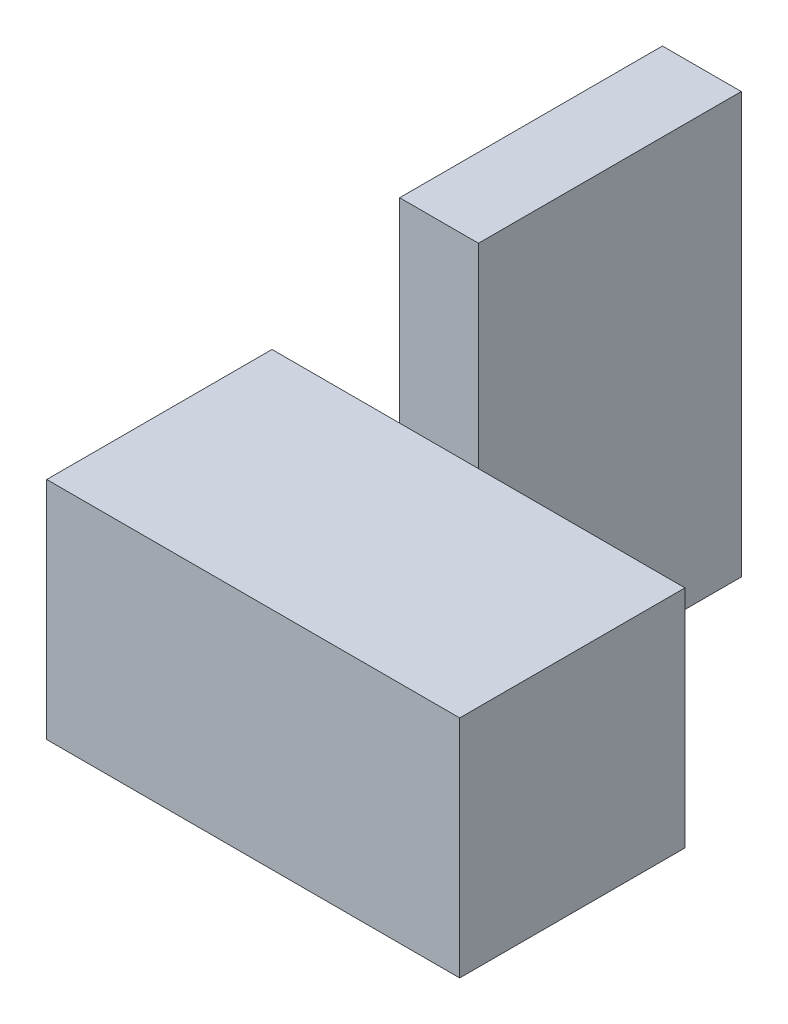
ISO-10303-21;
HEADER;
FILE_DESCRIPTION(('STEP AP214'),'2;1');
FILE_NAME('part.step','',(''),(''),'','','');
FILE_SCHEMA(('AUTOMOTIVE_DESIGN { 1 0 10303 214 1 1 1 1 }'));
ENDSEC;
DATA;
#1=APPLICATION_CONTEXT('core data for automotive mechanical design processes');
#2=APPLICATION_PROTOCOL_DEFINITION('international standard','automotive_design',2000,#1);
#3=PRODUCT_CONTEXT('',#1,'mechanical');
#4=PRODUCT('Part','Part','',(#3));
#5=PRODUCT_RELATED_PRODUCT_CATEGORY('part','',(#4));
#6=PRODUCT_DEFINITION_FORMATION('','',#4);
#7=PRODUCT_DEFINITION_CONTEXT('part definition',#1,'design');
#8=PRODUCT_DEFINITION('design','',#6,#7);
#9=PRODUCT_DEFINITION_SHAPE('','',#8);
#10=(LENGTH_UNIT() NAMED_UNIT(*) SI_UNIT(.MILLI.,.METRE.));
#11=(NAMED_UNIT(*) PLANE_ANGLE_UNIT() SI_UNIT($,.RADIAN.));
#12=(NAMED_UNIT(*) SI_UNIT($,.STERADIAN.) SOLID_ANGLE_UNIT());
#13=UNCERTAINTY_MEASURE_WITH_UNIT(LENGTH_MEASURE(1.E-05),#10,'distance_accuracy_value','');
#14=(GEOMETRIC_REPRESENTATION_CONTEXT(3) GLOBAL_UNCERTAINTY_ASSIGNED_CONTEXT((#13)) GLOBAL_UNIT_ASSIGNED_CONTEXT((#10,
#11,#12)) REPRESENTATION_CONTEXT('',''));
#15=CARTESIAN_POINT('',(0.,0.,0.));
#16=DIRECTION('',(0.,0.,1.));
#17=DIRECTION('',(1.,0.,0.));
#18=AXIS2_PLACEMENT_3D('',#15,#16,#17);
#19=CARTESIAN_POINT('',(27.5,30.,85.));
#20=DIRECTION('',(0.,0.,1.));
#21=DIRECTION('',(-1.,0.,0.));
#22=AXIS2_PLACEMENT_3D('',#19,#20,#21);
#23=PLANE('',#22);
#24=DIRECTION('',(0.,1.,0.));
#25=VECTOR('',#24,1.);
#26=CARTESIAN_POINT('',(0.,56.,85.));
#27=LINE('',#26,#25);
#28=CARTESIAN_POINT('',(0.,0.,85.));
#29=VERTEX_POINT('',#28);
#30=CARTESIAN_POINT('',(0.,30.,85.));
#31=VERTEX_POINT('',#30);
#32=EDGE_CURVE('E271',#29,#31,#27,.T.);
#33=ORIENTED_EDGE('',*,*,#32,.T.);
#34=DIRECTION('',(1.,0.,0.));
#35=VECTOR('',#34,1.);
#36=CARTESIAN_POINT('',(27.5,30.,85.));
#37=LINE('',#36,#35);
#38=CARTESIAN_POINT('',(27.5,30.,85.));
#39=VERTEX_POINT('',#38);
#40=EDGE_CURVE('E297',#31,#39,#37,.T.);
#41=ORIENTED_EDGE('',*,*,#40,.T.);
#42=DIRECTION('',(0.,-1.,0.));
#43=VECTOR('',#42,1.);
#44=CARTESIAN_POINT('',(27.5,30.,85.));
#45=LINE('',#44,#43);
#46=CARTESIAN_POINT('',(27.5,0.,85.));
#47=VERTEX_POINT('',#46);
#48=EDGE_CURVE('E331',#39,#47,#45,.T.);
#49=ORIENTED_EDGE('',*,*,#48,.T.);
#50=DIRECTION('',(1.,0.,0.));
#51=VECTOR('',#50,1.);
#52=CARTESIAN_POINT('',(27.5,0.,85.));
#53=LINE('',#52,#51);
#54=EDGE_CURVE('E314',#29,#47,#53,.T.);
#55=ORIENTED_EDGE('',*,*,#54,.F.);
#56=EDGE_LOOP('',(#33,#41,#49,#55));
#57=FACE_BOUND('',#56,.T.);
#58=ADVANCED_FACE('F42',(#57),#23,.F.);
#59=DIRECTION('',(0.,-1.,0.));
#60=VECTOR('',#59,1.);
#61=CARTESIAN_POINT('',(-10.5,56.,85.));
#62=LINE('',#61,#60);
#63=CARTESIAN_POINT('',(-10.5,30.,85.));
#64=VERTEX_POINT('',#63);
#65=CARTESIAN_POINT('',(-10.5,0.,85.));
#66=VERTEX_POINT('',#65);
#67=EDGE_CURVE('E11',#64,#66,#62,.T.);
#68=ORIENTED_EDGE('',*,*,#67,.T.);
#69=CARTESIAN_POINT('',(-27.5,0.,85.));
#70=VERTEX_POINT('',#69);
#71=EDGE_CURVE('E315',#70,#66,#53,.T.);
#72=ORIENTED_EDGE('',*,*,#71,.F.);
#73=DIRECTION('',(0.,-1.,0.));
#74=VECTOR('',#73,1.);
#75=CARTESIAN_POINT('',(-27.5,30.,85.));
#76=LINE('',#75,#74);
#77=CARTESIAN_POINT('',(-27.5,30.,85.));
#78=VERTEX_POINT('',#77);
#79=EDGE_CURVE('E46',#78,#70,#76,.T.);
#80=ORIENTED_EDGE('',*,*,#79,.F.);
#81=EDGE_CURVE('E299',#78,#64,#37,.T.);
#82=ORIENTED_EDGE('',*,*,#81,.T.);
#83=EDGE_LOOP('',(#68,#72,#80,#82));
#84=FACE_BOUND('',#83,.T.);
#85=ADVANCED_FACE('F348',(#84),#23,.F.);
#86=CARTESIAN_POINT('',(-27.5,30.,115.));
#87=DIRECTION('',(1.,0.,0.));
#88=DIRECTION('',(0.,0.,1.));
#89=AXIS2_PLACEMENT_3D('',#86,#87,#88);
#90=PLANE('',#89);
#91=DIRECTION('',(0.,0.,-1.));
#92=VECTOR('',#91,1.);
#93=CARTESIAN_POINT('',(-27.5,0.,115.));
#94=LINE('',#93,#92);
#95=CARTESIAN_POINT('',(-27.5,0.,115.));
#96=VERTEX_POINT('',#95);
#97=EDGE_CURVE('E293',#96,#70,#94,.T.);
#98=ORIENTED_EDGE('',*,*,#97,.F.);
#99=DIRECTION('',(0.,-1.,0.));
#100=VECTOR('',#99,1.);
#101=CARTESIAN_POINT('',(-27.5,30.,115.));
#102=LINE('',#101,#100);
#103=CARTESIAN_POINT('',(-27.5,30.,115.));
#104=VERTEX_POINT('',#103);
#105=EDGE_CURVE('E311',#104,#96,#102,.T.);
#106=ORIENTED_EDGE('',*,*,#105,.F.);
#107=DIRECTION('',(0.,0.,-1.));
#108=VECTOR('',#107,1.);
#109=CARTESIAN_POINT('',(-27.5,30.,115.));
#110=LINE('',#109,#108);
#111=EDGE_CURVE('E294',#104,#78,#110,.T.);
#112=ORIENTED_EDGE('',*,*,#111,.T.);
#113=ORIENTED_EDGE('',*,*,#79,.T.);
#114=EDGE_LOOP('',(#98,#106,#112,#113));
#115=FACE_BOUND('',#114,.T.);
#116=ADVANCED_FACE('F44',(#115),#90,.F.);
#117=CARTESIAN_POINT('',(27.5,30.,115.));
#118=DIRECTION('',(-1.,0.,0.));
#119=DIRECTION('',(0.,0.,-1.));
#120=AXIS2_PLACEMENT_3D('',#117,#118,#119);
#121=PLANE('',#120);
#122=DIRECTION('',(0.,0.,1.));
#123=VECTOR('',#122,1.);
#124=CARTESIAN_POINT('',(27.5,0.,115.));
#125=LINE('',#124,#123);
#126=CARTESIAN_POINT('',(27.5,0.,115.));
#127=VERTEX_POINT('',#126);
#128=EDGE_CURVE('E319',#47,#127,#125,.T.);
#129=ORIENTED_EDGE('',*,*,#128,.F.);
#130=ORIENTED_EDGE('',*,*,#48,.F.);
#131=DIRECTION('',(0.,0.,1.));
#132=VECTOR('',#131,1.);
#133=CARTESIAN_POINT('',(27.5,30.,115.));
#134=LINE('',#133,#132);
#135=CARTESIAN_POINT('',(27.5,30.,115.));
#136=VERTEX_POINT('',#135);
#137=EDGE_CURVE('E303',#39,#136,#134,.T.);
#138=ORIENTED_EDGE('',*,*,#137,.T.);
#139=DIRECTION('',(0.,-1.,0.));
#140=VECTOR('',#139,1.);
#141=CARTESIAN_POINT('',(27.5,30.,115.));
#142=LINE('',#141,#140);
#143=EDGE_CURVE('E328',#136,#127,#142,.T.);
#144=ORIENTED_EDGE('',*,*,#143,.T.);
#145=EDGE_LOOP('',(#129,#130,#138,#144));
#146=FACE_BOUND('',#145,.T.);
#147=ADVANCED_FACE('F381',(#146),#121,.F.);
#148=CARTESIAN_POINT('',(27.5,30.,115.));
#149=DIRECTION('',(0.,0.,-1.));
#150=DIRECTION('',(1.,0.,0.));
#151=AXIS2_PLACEMENT_3D('',#148,#149,#150);
#152=PLANE('',#151);
#153=DIRECTION('',(-1.,0.,0.));
#154=VECTOR('',#153,1.);
#155=CARTESIAN_POINT('',(27.5,0.,115.));
#156=LINE('',#155,#154);
#157=EDGE_CURVE('E298',#127,#96,#156,.T.);
#158=ORIENTED_EDGE('',*,*,#157,.F.);
#159=ORIENTED_EDGE('',*,*,#143,.F.);
#160=DIRECTION('',(-1.,0.,0.));
#161=VECTOR('',#160,1.);
#162=CARTESIAN_POINT('',(27.5,30.,115.));
#163=LINE('',#162,#161);
#164=EDGE_CURVE('E308',#136,#104,#163,.T.);
#165=ORIENTED_EDGE('',*,*,#164,.T.);
#166=ORIENTED_EDGE('',*,*,#105,.T.);
#167=EDGE_LOOP('',(#158,#159,#165,#166));
#168=FACE_BOUND('',#167,.T.);
#169=ADVANCED_FACE('F356',(#168),#152,.F.);
#170=CARTESIAN_POINT('',(0.,30.,100.));
#171=DIRECTION('',(0.,-1.,0.));
#172=DIRECTION('',(0.,0.,1.));
#173=AXIS2_PLACEMENT_3D('',#170,#171,#172);
#174=PLANE('',#173);
#175=ORIENTED_EDGE('',*,*,#111,.F.);
#176=ORIENTED_EDGE('',*,*,#164,.F.);
#177=ORIENTED_EDGE('',*,*,#137,.F.);
#178=ORIENTED_EDGE('',*,*,#40,.F.);
#179=EDGE_CURVE('E304',#64,#31,#37,.T.);
#180=ORIENTED_EDGE('',*,*,#179,.F.);
#181=ORIENTED_EDGE('',*,*,#81,.F.);
#182=EDGE_LOOP('',(#175,#176,#177,#178,#180,#181));
#183=FACE_BOUND('',#182,.T.);
#184=ADVANCED_FACE('F358',(#183),#174,.F.);
#185=CARTESIAN_POINT('',(0.,0.,100.));
#186=DIRECTION('',(0.,-1.,0.));
#187=DIRECTION('',(0.,0.,1.));
#188=AXIS2_PLACEMENT_3D('',#185,#186,#187);
#189=PLANE('',#188);
#190=ORIENTED_EDGE('',*,*,#97,.T.);
#191=ORIENTED_EDGE('',*,*,#71,.T.);
#192=DIRECTION('',(0.,0.,1.));
#193=VECTOR('',#192,1.);
#194=CARTESIAN_POINT('',(-10.5,0.,50.));
#195=LINE('',#194,#193);
#196=CARTESIAN_POINT('',(-10.5,0.,50.));
#197=VERTEX_POINT('',#196);
#198=EDGE_CURVE('E282',#197,#66,#195,.T.);
#199=ORIENTED_EDGE('',*,*,#198,.F.);
#200=DIRECTION('',(1.,0.,0.));
#201=VECTOR('',#200,1.);
#202=CARTESIAN_POINT('',(-10.5,0.,50.));
#203=LINE('',#202,#201);
#204=CARTESIAN_POINT('',(0.,0.,50.));
#205=VERTEX_POINT('',#204);
#206=EDGE_CURVE('E266',#197,#205,#203,.T.);
#207=ORIENTED_EDGE('',*,*,#206,.T.);
#208=DIRECTION('',(0.,0.,1.));
#209=VECTOR('',#208,1.);
#210=CARTESIAN_POINT('',(0.,0.,50.));
#211=LINE('',#210,#209);
#212=EDGE_CURVE('E270',#205,#29,#211,.T.);
#213=ORIENTED_EDGE('',*,*,#212,.T.);
#214=ORIENTED_EDGE('',*,*,#54,.T.);
#215=ORIENTED_EDGE('',*,*,#128,.T.);
#216=ORIENTED_EDGE('',*,*,#157,.T.);
#217=EDGE_LOOP('',(#190,#191,#199,#207,#213,#214,#215,#216));
#218=FACE_BOUND('',#217,.T.);
#219=ADVANCED_FACE('F352',(#218),#189,.T.);
#220=CARTESIAN_POINT('',(0.,56.,50.));
#221=DIRECTION('',(-1.,0.,0.));
#222=DIRECTION('',(0.,-1.,0.));
#223=AXIS2_PLACEMENT_3D('',#220,#221,#222);
#224=PLANE('',#223);
#225=ORIENTED_EDGE('',*,*,#32,.F.);
#226=ORIENTED_EDGE('',*,*,#212,.F.);
#227=DIRECTION('',(0.,1.,0.));
#228=VECTOR('',#227,1.);
#229=CARTESIAN_POINT('',(0.,56.,50.));
#230=LINE('',#229,#228);
#231=CARTESIAN_POINT('',(0.,56.,50.));
#232=VERTEX_POINT('',#231);
#233=EDGE_CURVE('E255',#205,#232,#230,.T.);
#234=ORIENTED_EDGE('',*,*,#233,.T.);
#235=DIRECTION('',(0.,0.,1.));
#236=VECTOR('',#235,1.);
#237=CARTESIAN_POINT('',(0.,56.,50.));
#238=LINE('',#237,#236);
#239=CARTESIAN_POINT('',(0.,56.,85.));
#240=VERTEX_POINT('',#239);
#241=EDGE_CURVE('E289',#232,#240,#238,.T.);
#242=ORIENTED_EDGE('',*,*,#241,.T.);
#243=EDGE_CURVE('E211',#31,#240,#27,.T.);
#244=ORIENTED_EDGE('',*,*,#243,.F.);
#245=EDGE_LOOP('',(#225,#226,#234,#242,#244));
#246=FACE_BOUND('',#245,.T.);
#247=ADVANCED_FACE('F372',(#246),#224,.F.);
#248=CARTESIAN_POINT('',(0.,56.,50.));
#249=DIRECTION('',(0.,-1.,0.));
#250=DIRECTION('',(0.,0.,1.));
#251=AXIS2_PLACEMENT_3D('',#248,#249,#250);
#252=PLANE('',#251);
#253=DIRECTION('',(-1.,0.,0.));
#254=VECTOR('',#253,1.);
#255=CARTESIAN_POINT('',(0.,56.,85.));
#256=LINE('',#255,#254);
#257=CARTESIAN_POINT('',(-10.5,56.,85.));
#258=VERTEX_POINT('',#257);
#259=EDGE_CURVE('E275',#240,#258,#256,.T.);
#260=ORIENTED_EDGE('',*,*,#259,.F.);
#261=ORIENTED_EDGE('',*,*,#241,.F.);
#262=DIRECTION('',(-1.,0.,0.));
#263=VECTOR('',#262,1.);
#264=CARTESIAN_POINT('',(0.,56.,50.));
#265=LINE('',#264,#263);
#266=CARTESIAN_POINT('',(-10.5,56.,50.));
#267=VERTEX_POINT('',#266);
#268=EDGE_CURVE('E259',#232,#267,#265,.T.);
#269=ORIENTED_EDGE('',*,*,#268,.T.);
#270=DIRECTION('',(0.,0.,1.));
#271=VECTOR('',#270,1.);
#272=CARTESIAN_POINT('',(-10.5,56.,50.));
#273=LINE('',#272,#271);
#274=EDGE_CURVE('E285',#267,#258,#273,.T.);
#275=ORIENTED_EDGE('',*,*,#274,.T.);
#276=EDGE_LOOP('',(#260,#261,#269,#275));
#277=FACE_BOUND('',#276,.T.);
#278=ADVANCED_FACE('F445',(#277),#252,.F.);
#279=CARTESIAN_POINT('',(-10.5,56.,50.));
#280=DIRECTION('',(1.,0.,0.));
#281=DIRECTION('',(0.,1.,0.));
#282=AXIS2_PLACEMENT_3D('',#279,#280,#281);
#283=PLANE('',#282);
#284=EDGE_CURVE('E53',#258,#64,#62,.T.);
#285=ORIENTED_EDGE('',*,*,#284,.F.);
#286=ORIENTED_EDGE('',*,*,#274,.F.);
#287=DIRECTION('',(0.,-1.,0.));
#288=VECTOR('',#287,1.);
#289=CARTESIAN_POINT('',(-10.5,56.,50.));
#290=LINE('',#289,#288);
#291=EDGE_CURVE('E263',#267,#197,#290,.T.);
#292=ORIENTED_EDGE('',*,*,#291,.T.);
#293=ORIENTED_EDGE('',*,*,#198,.T.);
#294=ORIENTED_EDGE('',*,*,#67,.F.);
#295=EDGE_LOOP('',(#285,#286,#292,#293,#294));
#296=FACE_BOUND('',#295,.T.);
#297=ADVANCED_FACE('F363',(#296),#283,.F.);
#298=CARTESIAN_POINT('',(0.,0.,50.));
#299=DIRECTION('',(0.,0.,-1.));
#300=DIRECTION('',(1.,0.,0.));
#301=AXIS2_PLACEMENT_3D('',#298,#299,#300);
#302=PLANE('',#301);
#303=DIRECTION('',(0.,-1.,0.));
#304=VECTOR('',#303,1.);
#305=CARTESIAN_POINT('',(-8.00000000000001,14.,50.));
#306=LINE('',#305,#304);
#307=CARTESIAN_POINT('',(-8.00000000000001,14.,50.));
#308=VERTEX_POINT('',#307);
#309=CARTESIAN_POINT('',(-8.00000000000001,3.,50.));
#310=VERTEX_POINT('',#309);
#311=EDGE_CURVE('E200',#308,#310,#306,.T.);
#312=ORIENTED_EDGE('',*,*,#311,.T.);
#313=DIRECTION('',(1.,0.,0.));
#314=VECTOR('',#313,1.);
#315=CARTESIAN_POINT('',(-2.50000000000001,3.,50.));
#316=LINE('',#315,#314);
#317=CARTESIAN_POINT('',(-2.50000000000001,3.,50.));
#318=VERTEX_POINT('',#317);
#319=EDGE_CURVE('E180',#310,#318,#316,.T.);
#320=ORIENTED_EDGE('',*,*,#319,.T.);
#321=DIRECTION('',(0.,1.,0.));
#322=VECTOR('',#321,1.);
#323=CARTESIAN_POINT('',(-2.50000000000002,14.,50.));
#324=LINE('',#323,#322);
#325=CARTESIAN_POINT('',(-2.50000000000002,14.,50.));
#326=VERTEX_POINT('',#325);
#327=EDGE_CURVE('E193',#318,#326,#324,.T.);
#328=ORIENTED_EDGE('',*,*,#327,.T.);
#329=DIRECTION('',(-1.,0.,0.));
#330=VECTOR('',#329,1.);
#331=CARTESIAN_POINT('',(-2.50000000000002,14.,50.));
#332=LINE('',#331,#330);
#333=EDGE_CURVE('E189',#326,#308,#332,.T.);
#334=ORIENTED_EDGE('',*,*,#333,.T.);
#335=EDGE_LOOP('',(#312,#320,#328,#334));
#336=FACE_BOUND('',#335,.T.);
#337=DIRECTION('',(0.,-1.,0.));
#338=VECTOR('',#337,1.);
#339=CARTESIAN_POINT('',(-8.00000000000001,53.,50.));
#340=LINE('',#339,#338);
#341=CARTESIAN_POINT('',(-8.00000000000001,53.,50.));
#342=VERTEX_POINT('',#341);
#343=CARTESIAN_POINT('',(-8.00000000000001,42.,50.));
#344=VERTEX_POINT('',#343);
#345=EDGE_CURVE('E203',#342,#344,#340,.T.);
#346=ORIENTED_EDGE('',*,*,#345,.T.);
#347=DIRECTION('',(1.,0.,0.));
#348=VECTOR('',#347,1.);
#349=CARTESIAN_POINT('',(-2.50000000000001,42.,50.));
#350=LINE('',#349,#348);
#351=CARTESIAN_POINT('',(-2.50000000000001,42.,50.));
#352=VERTEX_POINT('',#351);
#353=EDGE_CURVE('E238',#344,#352,#350,.T.);
#354=ORIENTED_EDGE('',*,*,#353,.T.);
#355=DIRECTION('',(0.,1.,0.));
#356=VECTOR('',#355,1.);
#357=CARTESIAN_POINT('',(-2.50000000000001,53.,50.));
#358=LINE('',#357,#356);
#359=CARTESIAN_POINT('',(-2.50000000000001,53.,50.));
#360=VERTEX_POINT('',#359);
#361=EDGE_CURVE('E233',#352,#360,#358,.T.);
#362=ORIENTED_EDGE('',*,*,#361,.T.);
#363=DIRECTION('',(-1.,0.,0.));
#364=VECTOR('',#363,1.);
#365=CARTESIAN_POINT('',(-2.50000000000001,53.,50.));
#366=LINE('',#365,#364);
#367=EDGE_CURVE('E229',#360,#342,#366,.T.);
#368=ORIENTED_EDGE('',*,*,#367,.T.);
#369=EDGE_LOOP('',(#346,#354,#362,#368));
#370=FACE_BOUND('',#369,.T.);
#371=ORIENTED_EDGE('',*,*,#233,.F.);
#372=ORIENTED_EDGE('',*,*,#206,.F.);
#373=ORIENTED_EDGE('',*,*,#291,.F.);
#374=ORIENTED_EDGE('',*,*,#268,.F.);
#375=EDGE_LOOP('',(#371,#372,#373,#374));
#376=FACE_BOUND('',#375,.T.);
#377=ADVANCED_FACE('F367',(#336,#370,#376),#302,.T.);
#378=CARTESIAN_POINT('',(0.,0.,85.));
#379=DIRECTION('',(0.,0.,-1.));
#380=DIRECTION('',(1.,0.,0.));
#381=AXIS2_PLACEMENT_3D('',#378,#379,#380);
#382=PLANE('',#381);
#383=ORIENTED_EDGE('',*,*,#179,.T.);
#384=ORIENTED_EDGE('',*,*,#243,.T.);
#385=ORIENTED_EDGE('',*,*,#259,.T.);
#386=ORIENTED_EDGE('',*,*,#284,.T.);
#387=EDGE_LOOP('',(#383,#384,#385,#386));
#388=FACE_BOUND('',#387,.T.);
#389=ADVANCED_FACE('F377',(#388),#382,.F.);
#390=CARTESIAN_POINT('',(-8.00000000000001,53.,72.));
#391=DIRECTION('',(-1.,0.,0.));
#392=DIRECTION('',(0.,-1.,0.));
#393=AXIS2_PLACEMENT_3D('',#390,#391,#392);
#394=PLANE('',#393);
#395=ORIENTED_EDGE('',*,*,#345,.F.);
#396=DIRECTION('',(0.,0.,-1.));
#397=VECTOR('',#396,1.);
#398=CARTESIAN_POINT('',(-8.00000000000001,53.,72.));
#399=LINE('',#398,#397);
#400=CARTESIAN_POINT('',(-8.00000000000001,53.,72.));
#401=VERTEX_POINT('',#400);
#402=EDGE_CURVE('E226',#401,#342,#399,.T.);
#403=ORIENTED_EDGE('',*,*,#402,.F.);
#404=DIRECTION('',(0.,-1.,0.));
#405=VECTOR('',#404,1.);
#406=CARTESIAN_POINT('',(-8.00000000000001,53.,72.));
#407=LINE('',#406,#405);
#408=CARTESIAN_POINT('',(-8.00000000000001,42.,72.));
#409=VERTEX_POINT('',#408);
#410=EDGE_CURVE('E234',#401,#409,#407,.T.);
#411=ORIENTED_EDGE('',*,*,#410,.T.);
#412=DIRECTION('',(0.,0.,-1.));
#413=VECTOR('',#412,1.);
#414=CARTESIAN_POINT('',(-8.00000000000001,42.,72.));
#415=LINE('',#414,#413);
#416=EDGE_CURVE('E68',#409,#344,#415,.T.);
#417=ORIENTED_EDGE('',*,*,#416,.T.);
#418=EDGE_LOOP('',(#395,#403,#411,#417));
#419=FACE_BOUND('',#418,.T.);
#420=ADVANCED_FACE('F484',(#419),#394,.F.);
#421=CARTESIAN_POINT('',(-2.50000000000001,53.,72.));
#422=DIRECTION('',(0.,1.,0.));
#423=DIRECTION('',(0.,0.,-1.));
#424=AXIS2_PLACEMENT_3D('',#421,#422,#423);
#425=PLANE('',#424);
#426=ORIENTED_EDGE('',*,*,#367,.F.);
#427=DIRECTION('',(0.,0.,-1.));
#428=VECTOR('',#427,1.);
#429=CARTESIAN_POINT('',(-2.50000000000001,53.,72.));
#430=LINE('',#429,#428);
#431=CARTESIAN_POINT('',(-2.50000000000001,53.,72.));
#432=VERTEX_POINT('',#431);
#433=EDGE_CURVE('E223',#432,#360,#430,.T.);
#434=ORIENTED_EDGE('',*,*,#433,.F.);
#435=DIRECTION('',(-1.,0.,0.));
#436=VECTOR('',#435,1.);
#437=CARTESIAN_POINT('',(-2.50000000000001,53.,72.));
#438=LINE('',#437,#436);
#439=EDGE_CURVE('E219',#432,#401,#438,.T.);
#440=ORIENTED_EDGE('',*,*,#439,.T.);
#441=ORIENTED_EDGE('',*,*,#402,.T.);
#442=EDGE_LOOP('',(#426,#434,#440,#441));
#443=FACE_BOUND('',#442,.T.);
#444=ADVANCED_FACE('F494',(#443),#425,.F.);
#445=CARTESIAN_POINT('',(-2.50000000000001,53.,72.));
#446=DIRECTION('',(1.,0.,0.));
#447=DIRECTION('',(0.,1.,0.));
#448=AXIS2_PLACEMENT_3D('',#445,#446,#447);
#449=PLANE('',#448);
#450=ORIENTED_EDGE('',*,*,#361,.F.);
#451=DIRECTION('',(0.,0.,-1.));
#452=VECTOR('',#451,1.);
#453=CARTESIAN_POINT('',(-2.50000000000001,42.,72.));
#454=LINE('',#453,#452);
#455=CARTESIAN_POINT('',(-2.50000000000001,42.,72.));
#456=VERTEX_POINT('',#455);
#457=EDGE_CURVE('E220',#456,#352,#454,.T.);
#458=ORIENTED_EDGE('',*,*,#457,.F.);
#459=DIRECTION('',(0.,1.,0.));
#460=VECTOR('',#459,1.);
#461=CARTESIAN_POINT('',(-2.50000000000001,53.,72.));
#462=LINE('',#461,#460);
#463=EDGE_CURVE('E247',#456,#432,#462,.T.);
#464=ORIENTED_EDGE('',*,*,#463,.T.);
#465=ORIENTED_EDGE('',*,*,#433,.T.);
#466=EDGE_LOOP('',(#450,#458,#464,#465));
#467=FACE_BOUND('',#466,.T.);
#468=ADVANCED_FACE('F504',(#467),#449,.F.);
#469=CARTESIAN_POINT('',(-2.50000000000001,42.,72.));
#470=DIRECTION('',(0.,-1.,0.));
#471=DIRECTION('',(0.,0.,1.));
#472=AXIS2_PLACEMENT_3D('',#469,#470,#471);
#473=PLANE('',#472);
#474=ORIENTED_EDGE('',*,*,#353,.F.);
#475=ORIENTED_EDGE('',*,*,#416,.F.);
#476=DIRECTION('',(1.,0.,0.));
#477=VECTOR('',#476,1.);
#478=CARTESIAN_POINT('',(-2.50000000000001,42.,72.));
#479=LINE('',#478,#477);
#480=EDGE_CURVE('E250',#409,#456,#479,.T.);
#481=ORIENTED_EDGE('',*,*,#480,.T.);
#482=ORIENTED_EDGE('',*,*,#457,.T.);
#483=EDGE_LOOP('',(#474,#475,#481,#482));
#484=FACE_BOUND('',#483,.T.);
#485=ADVANCED_FACE('F515',(#484),#473,.F.);
#486=CARTESIAN_POINT('',(0.,0.,72.));
#487=DIRECTION('',(0.,0.,1.));
#488=DIRECTION('',(-1.,0.,0.));
#489=AXIS2_PLACEMENT_3D('',#486,#487,#488);
#490=PLANE('',#489);
#491=ORIENTED_EDGE('',*,*,#410,.F.);
#492=ORIENTED_EDGE('',*,*,#439,.F.);
#493=ORIENTED_EDGE('',*,*,#463,.F.);
#494=ORIENTED_EDGE('',*,*,#480,.F.);
#495=EDGE_LOOP('',(#491,#492,#493,#494));
#496=FACE_BOUND('',#495,.T.);
#497=ADVANCED_FACE('F526',(#496),#490,.F.);
#498=CARTESIAN_POINT('',(-8.00000000000001,14.,72.));
#499=DIRECTION('',(-1.,0.,0.));
#500=DIRECTION('',(0.,-1.,0.));
#501=AXIS2_PLACEMENT_3D('',#498,#499,#500);
#502=PLANE('',#501);
#503=ORIENTED_EDGE('',*,*,#311,.F.);
#504=DIRECTION('',(0.,0.,-1.));
#505=VECTOR('',#504,1.);
#506=CARTESIAN_POINT('',(-8.00000000000001,14.,72.));
#507=LINE('',#506,#505);
#508=CARTESIAN_POINT('',(-8.00000000000001,14.,72.));
#509=VERTEX_POINT('',#508);
#510=EDGE_CURVE('E187',#509,#308,#507,.T.);
#511=ORIENTED_EDGE('',*,*,#510,.F.);
#512=DIRECTION('',(0.,-1.,0.));
#513=VECTOR('',#512,1.);
#514=CARTESIAN_POINT('',(-8.00000000000001,14.,72.));
#515=LINE('',#514,#513);
#516=CARTESIAN_POINT('',(-8.00000000000001,3.,72.));
#517=VERTEX_POINT('',#516);
#518=EDGE_CURVE('E171',#509,#517,#515,.T.);
#519=ORIENTED_EDGE('',*,*,#518,.T.);
#520=DIRECTION('',(0.,0.,-1.));
#521=VECTOR('',#520,1.);
#522=CARTESIAN_POINT('',(-8.00000000000001,3.,72.));
#523=LINE('',#522,#521);
#524=EDGE_CURVE('E60',#517,#310,#523,.T.);
#525=ORIENTED_EDGE('',*,*,#524,.T.);
#526=EDGE_LOOP('',(#503,#511,#519,#525));
#527=FACE_BOUND('',#526,.T.);
#528=ADVANCED_FACE('F186',(#527),#502,.F.);
#529=CARTESIAN_POINT('',(-2.50000000000002,14.,72.));
#530=DIRECTION('',(0.,1.,0.));
#531=DIRECTION('',(-1.,0.,0.));
#532=AXIS2_PLACEMENT_3D('',#529,#530,#531);
#533=PLANE('',#532);
#534=ORIENTED_EDGE('',*,*,#333,.F.);
#535=DIRECTION('',(0.,0.,-1.));
#536=VECTOR('',#535,1.);
#537=CARTESIAN_POINT('',(-2.50000000000002,14.,72.));
#538=LINE('',#537,#536);
#539=CARTESIAN_POINT('',(-2.50000000000002,14.,72.));
#540=VERTEX_POINT('',#539);
#541=EDGE_CURVE('E212',#540,#326,#538,.T.);
#542=ORIENTED_EDGE('',*,*,#541,.F.);
#543=DIRECTION('',(-1.,0.,0.));
#544=VECTOR('',#543,1.);
#545=CARTESIAN_POINT('',(-2.50000000000002,14.,72.));
#546=LINE('',#545,#544);
#547=EDGE_CURVE('E184',#540,#509,#546,.T.);
#548=ORIENTED_EDGE('',*,*,#547,.T.);
#549=ORIENTED_EDGE('',*,*,#510,.T.);
#550=EDGE_LOOP('',(#534,#542,#548,#549));
#551=FACE_BOUND('',#550,.T.);
#552=ADVANCED_FACE('F547',(#551),#533,.F.);
#553=CARTESIAN_POINT('',(-2.50000000000002,14.,72.));
#554=DIRECTION('',(1.,0.,0.));
#555=DIRECTION('',(0.,1.,0.));
#556=AXIS2_PLACEMENT_3D('',#553,#554,#555);
#557=PLANE('',#556);
#558=ORIENTED_EDGE('',*,*,#327,.F.);
#559=DIRECTION('',(0.,0.,-1.));
#560=VECTOR('',#559,1.);
#561=CARTESIAN_POINT('',(-2.50000000000001,3.,72.));
#562=LINE('',#561,#560);
#563=CARTESIAN_POINT('',(-2.50000000000001,3.,72.));
#564=VERTEX_POINT('',#563);
#565=EDGE_CURVE('E183',#564,#318,#562,.T.);
#566=ORIENTED_EDGE('',*,*,#565,.F.);
#567=DIRECTION('',(0.,1.,0.));
#568=VECTOR('',#567,1.);
#569=CARTESIAN_POINT('',(-2.50000000000002,14.,72.));
#570=LINE('',#569,#568);
#571=EDGE_CURVE('E173',#564,#540,#570,.T.);
#572=ORIENTED_EDGE('',*,*,#571,.T.);
#573=ORIENTED_EDGE('',*,*,#541,.T.);
#574=EDGE_LOOP('',(#558,#566,#572,#573));
#575=FACE_BOUND('',#574,.T.);
#576=ADVANCED_FACE('F557',(#575),#557,.F.);
#577=CARTESIAN_POINT('',(-2.50000000000001,3.,72.));
#578=DIRECTION('',(0.,-1.,0.));
#579=DIRECTION('',(1.,0.,0.));
#580=AXIS2_PLACEMENT_3D('',#577,#578,#579);
#581=PLANE('',#580);
#582=ORIENTED_EDGE('',*,*,#319,.F.);
#583=ORIENTED_EDGE('',*,*,#524,.F.);
#584=DIRECTION('',(1.,0.,0.));
#585=VECTOR('',#584,1.);
#586=CARTESIAN_POINT('',(-2.50000000000001,3.,72.));
#587=LINE('',#586,#585);
#588=EDGE_CURVE('E168',#517,#564,#587,.T.);
#589=ORIENTED_EDGE('',*,*,#588,.T.);
#590=ORIENTED_EDGE('',*,*,#565,.T.);
#591=EDGE_LOOP('',(#582,#583,#589,#590));
#592=FACE_BOUND('',#591,.T.);
#593=ADVANCED_FACE('F178',(#592),#581,.F.);
#594=CARTESIAN_POINT('',(0.,0.,72.));
#595=DIRECTION('',(0.,0.,1.));
#596=DIRECTION('',(-1.,0.,0.));
#597=AXIS2_PLACEMENT_3D('',#594,#595,#596);
#598=PLANE('',#597);
#599=ORIENTED_EDGE('',*,*,#518,.F.);
#600=ORIENTED_EDGE('',*,*,#547,.F.);
#601=ORIENTED_EDGE('',*,*,#571,.F.);
#602=ORIENTED_EDGE('',*,*,#588,.F.);
#603=EDGE_LOOP('',(#599,#600,#601,#602));
#604=FACE_BOUND('',#603,.T.);
#605=ADVANCED_FACE('F169',(#604),#598,.F.);
#606=CLOSED_SHELL('',(#58,#85,#116,#147,#169,#184,#219,#247,#278,#297,#377,#389,#420,#444,#468,
#485,#497,#528,#552,#576,#593,#605));
#607=MANIFOLD_SOLID_BREP('B2',#606);
#608=ADVANCED_BREP_SHAPE_REPRESENTATION('',(#18,#607),#14);
#609=SHAPE_DEFINITION_REPRESENTATION(#9,#608);
ENDSEC;
END-ISO-10303-21;
